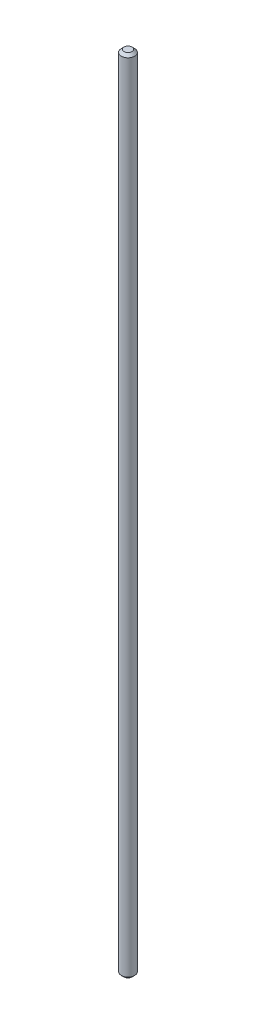
ISO-10303-21;
HEADER;
FILE_DESCRIPTION(('STEP AP214'),'2;1');
FILE_NAME('part.step','',(''),(''),'','','');
FILE_SCHEMA(('AUTOMOTIVE_DESIGN { 1 0 10303 214 1 1 1 1 }'));
ENDSEC;
DATA;
#1=APPLICATION_CONTEXT('core data for automotive mechanical design processes');
#2=APPLICATION_PROTOCOL_DEFINITION('international standard','automotive_design',2000,#1);
#3=PRODUCT_CONTEXT('',#1,'mechanical');
#4=PRODUCT('Part','Part','',(#3));
#5=PRODUCT_RELATED_PRODUCT_CATEGORY('part','',(#4));
#6=PRODUCT_DEFINITION_FORMATION('','',#4);
#7=PRODUCT_DEFINITION_CONTEXT('part definition',#1,'design');
#8=PRODUCT_DEFINITION('design','',#6,#7);
#9=PRODUCT_DEFINITION_SHAPE('','',#8);
#10=(LENGTH_UNIT() NAMED_UNIT(*) SI_UNIT(.MILLI.,.METRE.));
#11=(NAMED_UNIT(*) PLANE_ANGLE_UNIT() SI_UNIT($,.RADIAN.));
#12=(NAMED_UNIT(*) SI_UNIT($,.STERADIAN.) SOLID_ANGLE_UNIT());
#13=UNCERTAINTY_MEASURE_WITH_UNIT(LENGTH_MEASURE(1.E-05),#10,'distance_accuracy_value','');
#14=(GEOMETRIC_REPRESENTATION_CONTEXT(3) GLOBAL_UNCERTAINTY_ASSIGNED_CONTEXT((#13)) GLOBAL_UNIT_ASSIGNED_CONTEXT((#10,
#11,#12)) REPRESENTATION_CONTEXT('',''));
#15=CARTESIAN_POINT('',(0.,0.,0.));
#16=DIRECTION('',(0.,0.,1.));
#17=DIRECTION('',(1.,0.,0.));
#18=AXIS2_PLACEMENT_3D('',#15,#16,#17);
#19=CARTESIAN_POINT('',(0.,300.,0.));
#20=DIRECTION('',(0.,-1.,0.));
#21=DIRECTION('',(0.,0.,-1.));
#22=AXIS2_PLACEMENT_3D('',#19,#20,#21);
#23=CYLINDRICAL_SURFACE('',#22,2.5);
#24=CARTESIAN_POINT('',(0.,1.,0.));
#25=DIRECTION('',(0.,1.,0.));
#26=DIRECTION('',(0.,0.,1.));
#27=AXIS2_PLACEMENT_3D('',#24,#25,#26);
#28=CIRCLE('',#27,2.5);
#29=CARTESIAN_POINT('',(0.,1.,2.5));
#30=VERTEX_POINT('',#29);
#31=EDGE_CURVE('E46',#30,#30,#28,.T.);
#32=ORIENTED_EDGE('',*,*,#31,.T.);
#33=EDGE_LOOP('',(#32));
#34=FACE_BOUND('',#33,.T.);
#35=CARTESIAN_POINT('',(0.,299.,0.));
#36=DIRECTION('',(0.,1.,0.));
#37=DIRECTION('',(0.,0.,1.));
#38=AXIS2_PLACEMENT_3D('',#35,#36,#37);
#39=CIRCLE('',#38,2.5);
#40=CARTESIAN_POINT('',(0.,299.,2.5));
#41=VERTEX_POINT('',#40);
#42=EDGE_CURVE('E50',#41,#41,#39,.F.);
#43=ORIENTED_EDGE('',*,*,#42,.T.);
#44=EDGE_LOOP('',(#43));
#45=FACE_BOUND('',#44,.T.);
#46=ADVANCED_FACE('F34',(#34,#45),#23,.T.);
#47=CARTESIAN_POINT('',(0.,300.,0.));
#48=DIRECTION('',(0.,1.,0.));
#49=DIRECTION('',(0.,0.,1.));
#50=AXIS2_PLACEMENT_3D('',#47,#48,#49);
#51=PLANE('',#50);
#52=CARTESIAN_POINT('',(0.,300.,0.));
#53=DIRECTION('',(0.,1.,0.));
#54=DIRECTION('',(0.,0.,1.));
#55=AXIS2_PLACEMENT_3D('',#52,#53,#54);
#56=CIRCLE('',#55,1.49999999999997);
#57=CARTESIAN_POINT('',(0.,300.,1.49999999999997));
#58=VERTEX_POINT('',#57);
#59=EDGE_CURVE('E10',#58,#58,#56,.T.);
#60=ORIENTED_EDGE('',*,*,#59,.T.);
#61=EDGE_LOOP('',(#60));
#62=FACE_BOUND('',#61,.T.);
#63=ADVANCED_FACE('F66',(#62),#51,.T.);
#64=CARTESIAN_POINT('',(0.,0.,0.));
#65=DIRECTION('',(0.,1.,0.));
#66=DIRECTION('',(0.,0.,1.));
#67=AXIS2_PLACEMENT_3D('',#64,#65,#66);
#68=PLANE('',#67);
#69=CARTESIAN_POINT('',(0.,0.,0.));
#70=DIRECTION('',(0.,1.,0.));
#71=DIRECTION('',(0.,0.,1.));
#72=AXIS2_PLACEMENT_3D('',#69,#70,#71);
#73=CIRCLE('',#72,1.5);
#74=CARTESIAN_POINT('',(0.,0.,1.5));
#75=VERTEX_POINT('',#74);
#76=EDGE_CURVE('E42',#75,#75,#73,.F.);
#77=ORIENTED_EDGE('',*,*,#76,.T.);
#78=EDGE_LOOP('',(#77));
#79=FACE_BOUND('',#78,.T.);
#80=ADVANCED_FACE('F63',(#79),#68,.F.);
#81=CARTESIAN_POINT('',(0.,1.,0.));
#82=DIRECTION('',(0.,1.,0.));
#83=DIRECTION('',(0.,0.,1.));
#84=AXIS2_PLACEMENT_3D('',#81,#82,#83);
#85=CONICAL_SURFACE('',#84,2.5,0.785398163397447);
#86=ORIENTED_EDGE('',*,*,#76,.F.);
#87=EDGE_LOOP('',(#86));
#88=FACE_BOUND('',#87,.T.);
#89=ORIENTED_EDGE('',*,*,#31,.F.);
#90=EDGE_LOOP('',(#89));
#91=FACE_BOUND('',#90,.T.);
#92=ADVANCED_FACE('F59',(#88,#91),#85,.T.);
#93=CARTESIAN_POINT('',(0.,300.,0.));
#94=DIRECTION('',(0.,-1.,0.));
#95=DIRECTION('',(0.,0.,-1.));
#96=AXIS2_PLACEMENT_3D('',#93,#94,#95);
#97=CONICAL_SURFACE('',#96,1.49999999999997,0.785398163397489);
#98=ORIENTED_EDGE('',*,*,#42,.F.);
#99=EDGE_LOOP('',(#98));
#100=FACE_BOUND('',#99,.T.);
#101=ORIENTED_EDGE('',*,*,#59,.F.);
#102=EDGE_LOOP('',(#101));
#103=FACE_BOUND('',#102,.T.);
#104=ADVANCED_FACE('F37',(#100,#103),#97,.T.);
#105=CLOSED_SHELL('',(#46,#63,#80,#92,#104));
#106=MANIFOLD_SOLID_BREP('B2',#105);
#107=ADVANCED_BREP_SHAPE_REPRESENTATION('',(#18,#106),#14);
#108=SHAPE_DEFINITION_REPRESENTATION(#9,#107);
ENDSEC;
END-ISO-10303-21;
